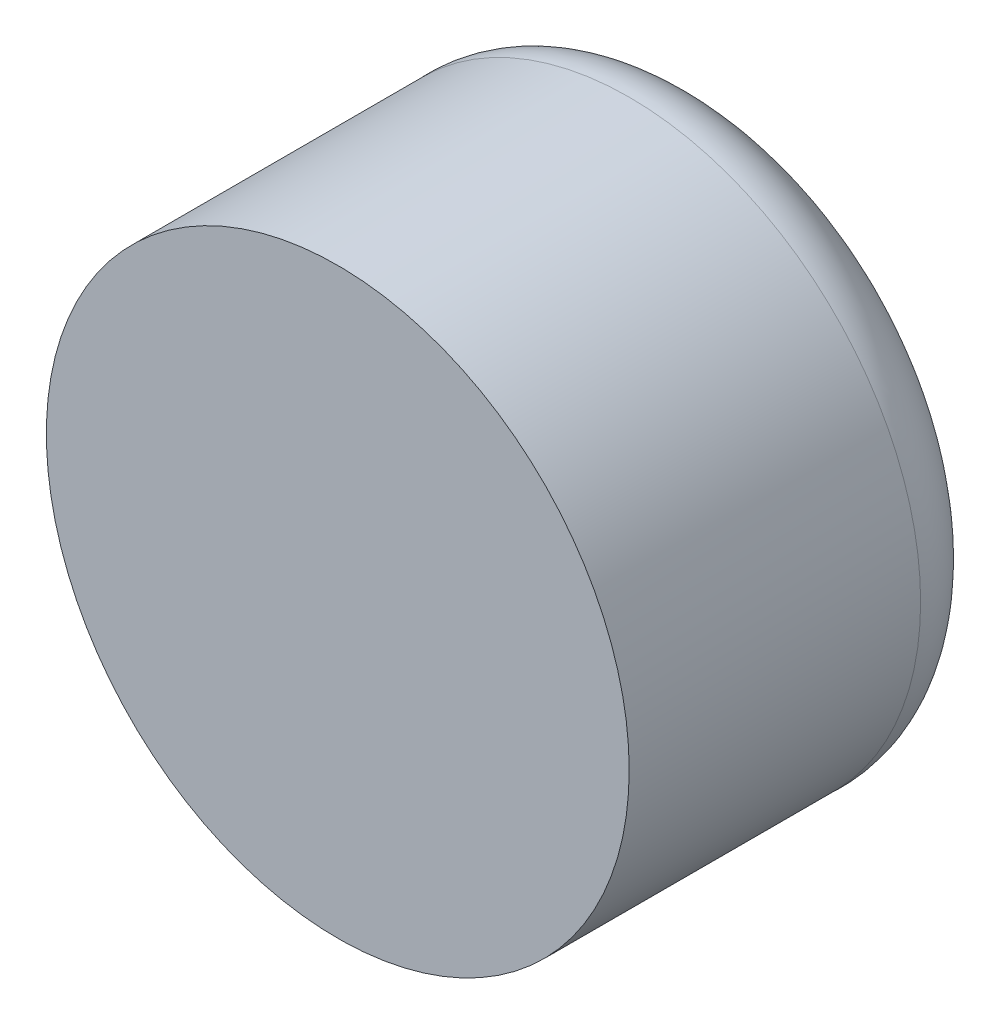
ISO-10303-21;
HEADER;
FILE_DESCRIPTION(('STEP AP214'),'2;1');
FILE_NAME('part.step','',(''),(''),'','','');
FILE_SCHEMA(('AUTOMOTIVE_DESIGN { 1 0 10303 214 1 1 1 1 }'));
ENDSEC;
DATA;
#1=APPLICATION_CONTEXT('core data for automotive mechanical design processes');
#2=APPLICATION_PROTOCOL_DEFINITION('international standard','automotive_design',2000,#1);
#3=PRODUCT_CONTEXT('',#1,'mechanical');
#4=PRODUCT('Part','Part','',(#3));
#5=PRODUCT_RELATED_PRODUCT_CATEGORY('part','',(#4));
#6=PRODUCT_DEFINITION_FORMATION('','',#4);
#7=PRODUCT_DEFINITION_CONTEXT('part definition',#1,'design');
#8=PRODUCT_DEFINITION('design','',#6,#7);
#9=PRODUCT_DEFINITION_SHAPE('','',#8);
#10=(LENGTH_UNIT() NAMED_UNIT(*) SI_UNIT(.MILLI.,.METRE.));
#11=(NAMED_UNIT(*) PLANE_ANGLE_UNIT() SI_UNIT($,.RADIAN.));
#12=(NAMED_UNIT(*) SI_UNIT($,.STERADIAN.) SOLID_ANGLE_UNIT());
#13=UNCERTAINTY_MEASURE_WITH_UNIT(LENGTH_MEASURE(1.E-05),#10,'distance_accuracy_value','');
#14=(GEOMETRIC_REPRESENTATION_CONTEXT(3) GLOBAL_UNCERTAINTY_ASSIGNED_CONTEXT((#13)) GLOBAL_UNIT_ASSIGNED_CONTEXT((#10,
#11,#12)) REPRESENTATION_CONTEXT('',''));
#15=CARTESIAN_POINT('',(0.,0.,0.));
#16=DIRECTION('',(0.,0.,1.));
#17=DIRECTION('',(1.,0.,0.));
#18=AXIS2_PLACEMENT_3D('',#15,#16,#17);
#19=CARTESIAN_POINT('',(0.,0.,250.));
#20=DIRECTION('',(0.,0.,-1.));
#21=DIRECTION('',(-1.,0.,0.));
#22=AXIS2_PLACEMENT_3D('',#19,#20,#21);
#23=CYLINDRICAL_SURFACE('',#22,250.);
#24=CARTESIAN_POINT('',(0.,0.,250.));
#25=DIRECTION('',(0.,0.,1.));
#26=DIRECTION('',(1.,0.,0.));
#27=AXIS2_PLACEMENT_3D('',#24,#25,#26);
#28=CIRCLE('',#27,250.);
#29=CARTESIAN_POINT('',(250.,0.,250.));
#30=VERTEX_POINT('',#29);
#31=EDGE_CURVE('E11',#30,#30,#28,.T.);
#32=ORIENTED_EDGE('',*,*,#31,.F.);
#33=EDGE_LOOP('',(#32));
#34=FACE_BOUND('',#33,.T.);
#35=CARTESIAN_POINT('',(0.,0.,0.));
#36=DIRECTION('',(0.,0.,1.));
#37=DIRECTION('',(1.,0.,0.));
#38=AXIS2_PLACEMENT_3D('',#35,#36,#37);
#39=CIRCLE('',#38,250.);
#40=CARTESIAN_POINT('',(250.,0.,0.));
#41=VERTEX_POINT('',#40);
#42=EDGE_CURVE('E39',#41,#41,#39,.T.);
#43=ORIENTED_EDGE('',*,*,#42,.T.);
#44=EDGE_LOOP('',(#43));
#45=FACE_BOUND('',#44,.T.);
#46=ADVANCED_FACE('F33',(#34,#45),#23,.T.);
#47=CARTESIAN_POINT('',(0.,0.,250.));
#48=DIRECTION('',(0.,0.,1.));
#49=DIRECTION('',(1.,0.,0.));
#50=AXIS2_PLACEMENT_3D('',#47,#48,#49);
#51=PLANE('',#50);
#52=ORIENTED_EDGE('',*,*,#31,.T.);
#53=EDGE_LOOP('',(#52));
#54=FACE_BOUND('',#53,.T.);
#55=ADVANCED_FACE('F44',(#54),#51,.T.);
#56=CARTESIAN_POINT('',(0.,0.,-100.));
#57=CARTESIAN_POINT('',(0.,27.6382991583376,-98.7571194867444));
#58=CARTESIAN_POINT('',(0.,257.417440465118,-99.7142714767885));
#59=CARTESIAN_POINT('',(0.,250.,0.));
#60=B_SPLINE_CURVE_WITH_KNOTS('',3,(#56,#57,#58,#59),.UNSPECIFIED.,.F.,.F.,(4,4),(0.,1.),.UNSPECIFIED.);
#61=CARTESIAN_POINT('',(0.,0.,0.));
#62=DIRECTION('',(0.,0.,1.));
#63=AXIS1_PLACEMENT('',#61,#62);
#64=SURFACE_OF_REVOLUTION('',#60,#63);
#65=ORIENTED_EDGE('',*,*,#42,.F.);
#66=EDGE_LOOP('',(#65));
#67=FACE_BOUND('',#66,.T.);
#68=CARTESIAN_POINT('',(0.,0.,-100.));
#69=VERTEX_POINT('',#68);
#70=VERTEX_LOOP('',#69);
#71=FACE_BOUND('',#70,.T.);
#72=ADVANCED_FACE('F42',(#67,#71),#64,.T.);
#73=CLOSED_SHELL('',(#46,#55,#72));
#74=MANIFOLD_SOLID_BREP('B2',#73);
#75=ADVANCED_BREP_SHAPE_REPRESENTATION('',(#18,#74),#14);
#76=SHAPE_DEFINITION_REPRESENTATION(#9,#75);
ENDSEC;
END-ISO-10303-21;
